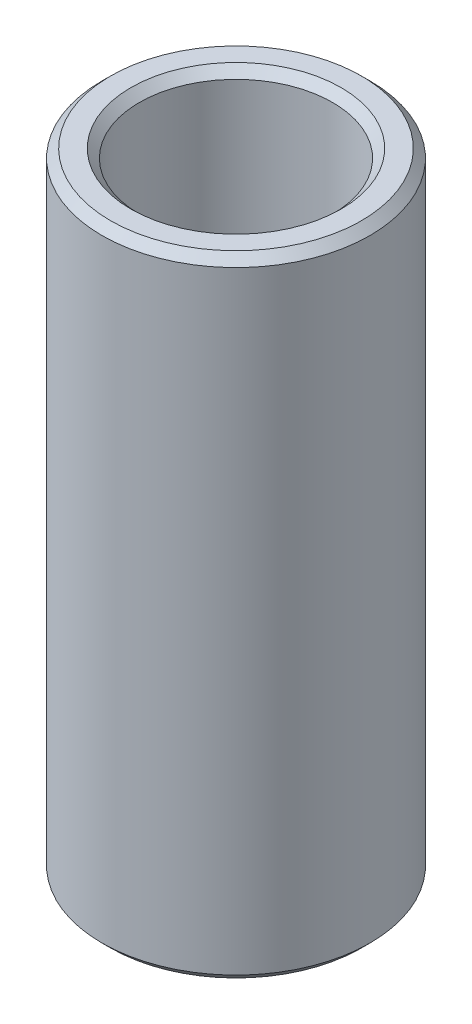
ISO-10303-21;
HEADER;
FILE_DESCRIPTION(('STEP AP214'),'2;1');
FILE_NAME('part.step','',(''),(''),'','','');
FILE_SCHEMA(('AUTOMOTIVE_DESIGN { 1 0 10303 214 1 1 1 1 }'));
ENDSEC;
DATA;
#1=APPLICATION_CONTEXT('core data for automotive mechanical design processes');
#2=APPLICATION_PROTOCOL_DEFINITION('international standard','automotive_design',2000,#1);
#3=PRODUCT_CONTEXT('',#1,'mechanical');
#4=PRODUCT('Part','Part','',(#3));
#5=PRODUCT_RELATED_PRODUCT_CATEGORY('part','',(#4));
#6=PRODUCT_DEFINITION_FORMATION('','',#4);
#7=PRODUCT_DEFINITION_CONTEXT('part definition',#1,'design');
#8=PRODUCT_DEFINITION('design','',#6,#7);
#9=PRODUCT_DEFINITION_SHAPE('','',#8);
#10=(LENGTH_UNIT() NAMED_UNIT(*) SI_UNIT(.MILLI.,.METRE.));
#11=(NAMED_UNIT(*) PLANE_ANGLE_UNIT() SI_UNIT($,.RADIAN.));
#12=(NAMED_UNIT(*) SI_UNIT($,.STERADIAN.) SOLID_ANGLE_UNIT());
#13=UNCERTAINTY_MEASURE_WITH_UNIT(LENGTH_MEASURE(1.E-05),#10,'distance_accuracy_value','');
#14=(GEOMETRIC_REPRESENTATION_CONTEXT(3) GLOBAL_UNCERTAINTY_ASSIGNED_CONTEXT((#13)) GLOBAL_UNIT_ASSIGNED_CONTEXT((#10,
#11,#12)) REPRESENTATION_CONTEXT('',''));
#15=CARTESIAN_POINT('',(0.,0.,0.));
#16=DIRECTION('',(0.,0.,1.));
#17=DIRECTION('',(1.,0.,0.));
#18=AXIS2_PLACEMENT_3D('',#15,#16,#17);
#19=CARTESIAN_POINT('',(0.,223.310376290081,0.));
#20=DIRECTION('',(0.,-1.,0.));
#21=DIRECTION('',(0.,0.,-1.));
#22=AXIS2_PLACEMENT_3D('',#19,#20,#21);
#23=CYLINDRICAL_SURFACE('',#22,47.5);
#24=CARTESIAN_POINT('',(0.,3.03487224260776,0.));
#25=DIRECTION('',(0.,1.,0.));
#26=DIRECTION('',(0.,0.,1.));
#27=AXIS2_PLACEMENT_3D('',#24,#25,#26);
#28=CIRCLE('',#27,47.5);
#29=CARTESIAN_POINT('',(0.,3.03487224260776,47.5));
#30=VERTEX_POINT('',#29);
#31=EDGE_CURVE('E10',#30,#30,#28,.T.);
#32=ORIENTED_EDGE('',*,*,#31,.T.);
#33=EDGE_LOOP('',(#32));
#34=FACE_BOUND('',#33,.T.);
#35=CARTESIAN_POINT('',(0.,220.275504047473,0.));
#36=DIRECTION('',(0.,1.,0.));
#37=DIRECTION('',(0.,0.,1.));
#38=AXIS2_PLACEMENT_3D('',#35,#36,#37);
#39=CIRCLE('',#38,47.5);
#40=CARTESIAN_POINT('',(0.,220.275504047473,47.5));
#41=VERTEX_POINT('',#40);
#42=EDGE_CURVE('E50',#41,#41,#39,.F.);
#43=ORIENTED_EDGE('',*,*,#42,.T.);
#44=EDGE_LOOP('',(#43));
#45=FACE_BOUND('',#44,.T.);
#46=ADVANCED_FACE('F39',(#34,#45),#23,.T.);
#47=CARTESIAN_POINT('',(0.,223.310376290081,0.));
#48=DIRECTION('',(0.,1.,0.));
#49=DIRECTION('',(0.,0.,1.));
#50=AXIS2_PLACEMENT_3D('',#47,#48,#49);
#51=PLANE('',#50);
#52=CARTESIAN_POINT('',(0.,223.310376290081,0.));
#53=DIRECTION('',(0.,1.,0.));
#54=DIRECTION('',(0.,0.,1.));
#55=AXIS2_PLACEMENT_3D('',#52,#53,#54);
#56=CIRCLE('',#55,37.2946489623167);
#57=CARTESIAN_POINT('',(0.,223.310376290081,37.2946489623167));
#58=VERTEX_POINT('',#57);
#59=EDGE_CURVE('E58',#58,#58,#56,.F.);
#60=ORIENTED_EDGE('',*,*,#59,.T.);
#61=EDGE_LOOP('',(#60));
#62=FACE_BOUND('',#61,.T.);
#63=CARTESIAN_POINT('',(0.,223.310376290081,0.));
#64=DIRECTION('',(0.,1.,0.));
#65=DIRECTION('',(0.,0.,1.));
#66=AXIS2_PLACEMENT_3D('',#63,#64,#65);
#67=CIRCLE('',#66,44.4651277573923);
#68=CARTESIAN_POINT('',(0.,223.310376290081,44.4651277573923));
#69=VERTEX_POINT('',#68);
#70=EDGE_CURVE('E61',#69,#69,#67,.T.);
#71=ORIENTED_EDGE('',*,*,#70,.T.);
#72=EDGE_LOOP('',(#71));
#73=FACE_BOUND('',#72,.T.);
#74=ADVANCED_FACE('F88',(#62,#73),#51,.T.);
#75=CARTESIAN_POINT('',(0.,0.,0.));
#76=DIRECTION('',(0.,1.,0.));
#77=DIRECTION('',(0.,0.,1.));
#78=AXIS2_PLACEMENT_3D('',#75,#76,#77);
#79=PLANE('',#78);
#80=CARTESIAN_POINT('',(0.,0.,0.));
#81=DIRECTION('',(0.,1.,0.));
#82=DIRECTION('',(0.,0.,1.));
#83=AXIS2_PLACEMENT_3D('',#80,#81,#82);
#84=CIRCLE('',#83,37.2946489623166);
#85=CARTESIAN_POINT('',(0.,0.,37.2946489623166));
#86=VERTEX_POINT('',#85);
#87=EDGE_CURVE('E51',#86,#86,#84,.T.);
#88=ORIENTED_EDGE('',*,*,#87,.T.);
#89=EDGE_LOOP('',(#88));
#90=FACE_BOUND('',#89,.T.);
#91=CARTESIAN_POINT('',(0.,0.,0.));
#92=DIRECTION('',(0.,1.,0.));
#93=DIRECTION('',(0.,0.,1.));
#94=AXIS2_PLACEMENT_3D('',#91,#92,#93);
#95=CIRCLE('',#94,44.4651277573922);
#96=CARTESIAN_POINT('',(0.,0.,44.4651277573922));
#97=VERTEX_POINT('',#96);
#98=EDGE_CURVE('E54',#97,#97,#95,.F.);
#99=ORIENTED_EDGE('',*,*,#98,.T.);
#100=EDGE_LOOP('',(#99));
#101=FACE_BOUND('',#100,.T.);
#102=ADVANCED_FACE('F83',(#90,#101),#79,.F.);
#103=CARTESIAN_POINT('',(0.,223.310376290081,0.));
#104=DIRECTION('',(0.,-1.,0.));
#105=DIRECTION('',(0.,0.,-1.));
#106=AXIS2_PLACEMENT_3D('',#103,#104,#105);
#107=CYLINDRICAL_SURFACE('',#106,34.2597767197089);
#108=CARTESIAN_POINT('',(0.,220.275504047473,0.));
#109=DIRECTION('',(0.,1.,0.));
#110=DIRECTION('',(0.,0.,1.));
#111=AXIS2_PLACEMENT_3D('',#108,#109,#110);
#112=CIRCLE('',#111,34.2597767197089);
#113=CARTESIAN_POINT('',(0.,220.275504047473,34.2597767197089));
#114=VERTEX_POINT('',#113);
#115=EDGE_CURVE('E67',#114,#114,#112,.T.);
#116=ORIENTED_EDGE('',*,*,#115,.T.);
#117=EDGE_LOOP('',(#116));
#118=FACE_BOUND('',#117,.T.);
#119=CARTESIAN_POINT('',(0.,3.03487224260773,0.));
#120=DIRECTION('',(0.,1.,0.));
#121=DIRECTION('',(0.,0.,1.));
#122=AXIS2_PLACEMENT_3D('',#119,#120,#121);
#123=CIRCLE('',#122,34.2597767197089);
#124=CARTESIAN_POINT('',(0.,3.03487224260773,34.2597767197089));
#125=VERTEX_POINT('',#124);
#126=EDGE_CURVE('E69',#125,#125,#123,.F.);
#127=ORIENTED_EDGE('',*,*,#126,.T.);
#128=EDGE_LOOP('',(#127));
#129=FACE_BOUND('',#128,.T.);
#130=ADVANCED_FACE('F71',(#118,#129),#107,.F.);
#131=CARTESIAN_POINT('',(0.,220.275504047473,0.));
#132=DIRECTION('',(0.,1.,0.));
#133=DIRECTION('',(0.,0.,1.));
#134=AXIS2_PLACEMENT_3D('',#131,#132,#133);
#135=CONICAL_SURFACE('',#134,34.2597767197089,0.785398163397451);
#136=ORIENTED_EDGE('',*,*,#59,.F.);
#137=EDGE_LOOP('',(#136));
#138=FACE_BOUND('',#137,.T.);
#139=ORIENTED_EDGE('',*,*,#115,.F.);
#140=EDGE_LOOP('',(#139));
#141=FACE_BOUND('',#140,.T.);
#142=ADVANCED_FACE('F77',(#138,#141),#135,.F.);
#143=CARTESIAN_POINT('',(0.,0.,0.));
#144=DIRECTION('',(0.,-1.,0.));
#145=DIRECTION('',(0.,0.,-1.));
#146=AXIS2_PLACEMENT_3D('',#143,#144,#145);
#147=CONICAL_SURFACE('',#146,37.2946489623166,0.785398163397446);
#148=ORIENTED_EDGE('',*,*,#126,.F.);
#149=EDGE_LOOP('',(#148));
#150=FACE_BOUND('',#149,.T.);
#151=ORIENTED_EDGE('',*,*,#87,.F.);
#152=EDGE_LOOP('',(#151));
#153=FACE_BOUND('',#152,.T.);
#154=ADVANCED_FACE('F73',(#150,#153),#147,.F.);
#155=CARTESIAN_POINT('',(0.,3.03487224260776,0.));
#156=DIRECTION('',(0.,1.,0.));
#157=DIRECTION('',(0.,0.,1.));
#158=AXIS2_PLACEMENT_3D('',#155,#156,#157);
#159=CONICAL_SURFACE('',#158,47.5,0.785398163397452);
#160=ORIENTED_EDGE('',*,*,#98,.F.);
#161=EDGE_LOOP('',(#160));
#162=FACE_BOUND('',#161,.T.);
#163=ORIENTED_EDGE('',*,*,#31,.F.);
#164=EDGE_LOOP('',(#163));
#165=FACE_BOUND('',#164,.T.);
#166=ADVANCED_FACE('F76',(#162,#165),#159,.T.);
#167=CARTESIAN_POINT('',(0.,223.310376290081,0.));
#168=DIRECTION('',(0.,-1.,0.));
#169=DIRECTION('',(0.,0.,-1.));
#170=AXIS2_PLACEMENT_3D('',#167,#168,#169);
#171=CONICAL_SURFACE('',#170,44.4651277573923,0.785398163397448);
#172=ORIENTED_EDGE('',*,*,#42,.F.);
#173=EDGE_LOOP('',(#172));
#174=FACE_BOUND('',#173,.T.);
#175=ORIENTED_EDGE('',*,*,#70,.F.);
#176=EDGE_LOOP('',(#175));
#177=FACE_BOUND('',#176,.T.);
#178=ADVANCED_FACE('F45',(#174,#177),#171,.T.);
#179=CLOSED_SHELL('',(#46,#74,#102,#130,#142,#154,#166,#178));
#180=MANIFOLD_SOLID_BREP('B2',#179);
#181=ADVANCED_BREP_SHAPE_REPRESENTATION('',(#18,#180),#14);
#182=SHAPE_DEFINITION_REPRESENTATION(#9,#181);
ENDSEC;
END-ISO-10303-21;
